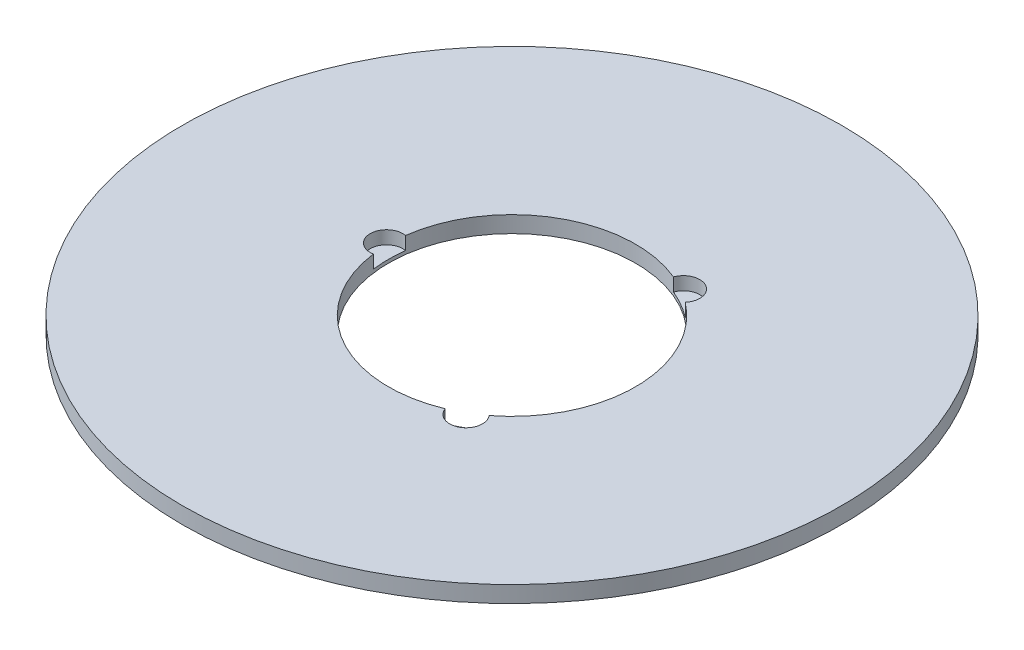
ISO-10303-21;
HEADER;
FILE_DESCRIPTION(('STEP AP214'),'2;1');
FILE_NAME('part.step','',(''),(''),'','','');
FILE_SCHEMA(('AUTOMOTIVE_DESIGN { 1 0 10303 214 1 1 1 1 }'));
ENDSEC;
DATA;
#1=APPLICATION_CONTEXT('core data for automotive mechanical design processes');
#2=APPLICATION_PROTOCOL_DEFINITION('international standard','automotive_design',2000,#1);
#3=PRODUCT_CONTEXT('',#1,'mechanical');
#4=PRODUCT('Part','Part','',(#3));
#5=PRODUCT_RELATED_PRODUCT_CATEGORY('part','',(#4));
#6=PRODUCT_DEFINITION_FORMATION('','',#4);
#7=PRODUCT_DEFINITION_CONTEXT('part definition',#1,'design');
#8=PRODUCT_DEFINITION('design','',#6,#7);
#9=PRODUCT_DEFINITION_SHAPE('','',#8);
#10=(LENGTH_UNIT() NAMED_UNIT(*) SI_UNIT(.MILLI.,.METRE.));
#11=(NAMED_UNIT(*) PLANE_ANGLE_UNIT() SI_UNIT($,.RADIAN.));
#12=(NAMED_UNIT(*) SI_UNIT($,.STERADIAN.) SOLID_ANGLE_UNIT());
#13=UNCERTAINTY_MEASURE_WITH_UNIT(LENGTH_MEASURE(1.E-05),#10,'distance_accuracy_value','');
#14=(GEOMETRIC_REPRESENTATION_CONTEXT(3) GLOBAL_UNCERTAINTY_ASSIGNED_CONTEXT((#13)) GLOBAL_UNIT_ASSIGNED_CONTEXT((#10,
#11,#12)) REPRESENTATION_CONTEXT('',''));
#15=CARTESIAN_POINT('',(0.,0.,0.));
#16=DIRECTION('',(0.,0.,1.));
#17=DIRECTION('',(1.,0.,0.));
#18=AXIS2_PLACEMENT_3D('',#15,#16,#17);
#19=CARTESIAN_POINT('',(0.,4.,0.));
#20=DIRECTION('',(0.,-1.,0.));
#21=DIRECTION('',(0.,0.,-1.));
#22=AXIS2_PLACEMENT_3D('',#19,#20,#21);
#23=CYLINDRICAL_SURFACE('',#22,80.);
#24=CARTESIAN_POINT('',(0.,4.,0.));
#25=DIRECTION('',(0.,1.,0.));
#26=DIRECTION('',(0.,0.,1.));
#27=AXIS2_PLACEMENT_3D('',#24,#25,#26);
#28=CIRCLE('',#27,80.);
#29=CARTESIAN_POINT('',(0.,4.,80.));
#30=VERTEX_POINT('',#29);
#31=EDGE_CURVE('E126',#30,#30,#28,.T.);
#32=ORIENTED_EDGE('',*,*,#31,.F.);
#33=EDGE_LOOP('',(#32));
#34=FACE_BOUND('',#33,.T.);
#35=CARTESIAN_POINT('',(0.,0.,0.));
#36=DIRECTION('',(0.,1.,0.));
#37=DIRECTION('',(0.,0.,1.));
#38=AXIS2_PLACEMENT_3D('',#35,#36,#37);
#39=CIRCLE('',#38,80.);
#40=CARTESIAN_POINT('',(0.,0.,80.));
#41=VERTEX_POINT('',#40);
#42=EDGE_CURVE('E124',#41,#41,#39,.T.);
#43=ORIENTED_EDGE('',*,*,#42,.T.);
#44=EDGE_LOOP('',(#43));
#45=FACE_BOUND('',#44,.T.);
#46=ADVANCED_FACE('F39',(#34,#45),#23,.T.);
#47=CARTESIAN_POINT('',(0.,4.,0.));
#48=DIRECTION('',(0.,1.,0.));
#49=DIRECTION('',(0.,0.,1.));
#50=AXIS2_PLACEMENT_3D('',#47,#48,#49);
#51=PLANE('',#50);
#52=CARTESIAN_POINT('',(15.2293132212951,4.,26.3779442636633));
#53=DIRECTION('',(0.,1.,0.));
#54=DIRECTION('',(0.866025403784436,0.,-0.500000000000004));
#55=AXIS2_PLACEMENT_3D('',#52,#53,#54);
#56=CIRCLE('',#55,3.96898372073853);
#57=CARTESIAN_POINT('',(11.4912276367644,4.,27.711941242));
#58=VERTEX_POINT('',#57);
#59=CARTESIAN_POINT('',(18.2536312853717,4.,23.8076656751077));
#60=VERTEX_POINT('',#59);
#61=EDGE_CURVE('E147',#58,#60,#56,.T.);
#62=ORIENTED_EDGE('',*,*,#61,.F.);
#63=CARTESIAN_POINT('',(0.,4.,0.));
#64=DIRECTION('',(0.,1.,0.));
#65=DIRECTION('',(0.,0.,1.));
#66=AXIS2_PLACEMENT_3D('',#63,#64,#65);
#67=CIRCLE('',#66,30.);
#68=CARTESIAN_POINT('',(-29.7448589221359,4.,3.90427556689231));
#69=VERTEX_POINT('',#68);
#70=EDGE_CURVE('E118',#69,#58,#67,.T.);
#71=ORIENTED_EDGE('',*,*,#70,.F.);
#72=CARTESIAN_POINT('',(-30.45862644259,4.,0.));
#73=DIRECTION('',(0.,1.,0.));
#74=DIRECTION('',(0.,0.,1.));
#75=AXIS2_PLACEMENT_3D('',#72,#73,#74);
#76=CIRCLE('',#75,3.96898372073853);
#77=CARTESIAN_POINT('',(-29.7448589221359,4.,-3.90427556689231));
#78=VERTEX_POINT('',#77);
#79=EDGE_CURVE('E113',#78,#69,#76,.T.);
#80=ORIENTED_EDGE('',*,*,#79,.F.);
#81=CARTESIAN_POINT('',(11.4912276367641,4.,-27.7119412420002));
#82=VERTEX_POINT('',#81);
#83=EDGE_CURVE('E106',#82,#78,#67,.T.);
#84=ORIENTED_EDGE('',*,*,#83,.F.);
#85=CARTESIAN_POINT('',(15.2293132212947,4.,-26.3779442636635));
#86=DIRECTION('',(0.,1.,0.));
#87=DIRECTION('',(-0.866025403784443,0.,-0.499999999999992));
#88=AXIS2_PLACEMENT_3D('',#85,#86,#87);
#89=CIRCLE('',#88,3.96898372073853);
#90=CARTESIAN_POINT('',(18.2536312853714,4.,-23.8076656751079));
#91=VERTEX_POINT('',#90);
#92=EDGE_CURVE('E90',#91,#82,#89,.T.);
#93=ORIENTED_EDGE('',*,*,#92,.F.);
#94=EDGE_CURVE('E116',#60,#91,#67,.T.);
#95=ORIENTED_EDGE('',*,*,#94,.F.);
#96=EDGE_LOOP('',(#62,#71,#80,#84,#93,#95));
#97=FACE_BOUND('',#96,.T.);
#98=ORIENTED_EDGE('',*,*,#31,.T.);
#99=EDGE_LOOP('',(#98));
#100=FACE_BOUND('',#99,.T.);
#101=ADVANCED_FACE('F115',(#97,#100),#51,.T.);
#102=CARTESIAN_POINT('',(0.,0.,0.));
#103=DIRECTION('',(0.,1.,0.));
#104=DIRECTION('',(0.,0.,1.));
#105=AXIS2_PLACEMENT_3D('',#102,#103,#104);
#106=PLANE('',#105);
#107=CARTESIAN_POINT('',(0.,0.,0.));
#108=DIRECTION('',(0.,1.,0.));
#109=DIRECTION('',(0.,0.,1.));
#110=AXIS2_PLACEMENT_3D('',#107,#108,#109);
#111=CIRCLE('',#110,30.);
#112=CARTESIAN_POINT('',(0.,0.,30.));
#113=VERTEX_POINT('',#112);
#114=EDGE_CURVE('E120',#113,#113,#111,.T.);
#115=ORIENTED_EDGE('',*,*,#114,.T.);
#116=EDGE_LOOP('',(#115));
#117=FACE_BOUND('',#116,.T.);
#118=ORIENTED_EDGE('',*,*,#42,.F.);
#119=EDGE_LOOP('',(#118));
#120=FACE_BOUND('',#119,.T.);
#121=ADVANCED_FACE('F164',(#117,#120),#106,.F.);
#122=CARTESIAN_POINT('',(0.,4.,0.));
#123=DIRECTION('',(0.,-1.,0.));
#124=DIRECTION('',(0.,0.,-1.));
#125=AXIS2_PLACEMENT_3D('',#122,#123,#124);
#126=CYLINDRICAL_SURFACE('',#125,30.);
#127=DIRECTION('',(0.,1.,0.));
#128=VECTOR('',#127,1.);
#129=CARTESIAN_POINT('',(11.4912276367644,2.40815884824266,27.711941242));
#130=LINE('',#129,#128);
#131=CARTESIAN_POINT('',(11.4912276367644,0.816317696485319,27.711941242));
#132=VERTEX_POINT('',#131);
#133=EDGE_CURVE('E11',#132,#58,#130,.T.);
#134=ORIENTED_EDGE('',*,*,#133,.F.);
#135=CARTESIAN_POINT('',(0.,0.816317696485319,0.));
#136=DIRECTION('',(0.,1.,0.));
#137=DIRECTION('',(0.,0.,1.));
#138=AXIS2_PLACEMENT_3D('',#135,#136,#137);
#139=CIRCLE('',#138,30.);
#140=CARTESIAN_POINT('',(18.2536312853717,0.816317696485319,23.8076656751077));
#141=VERTEX_POINT('',#140);
#142=EDGE_CURVE('E144',#132,#141,#139,.T.);
#143=ORIENTED_EDGE('',*,*,#142,.T.);
#144=DIRECTION('',(0.,1.,0.));
#145=VECTOR('',#144,1.);
#146=CARTESIAN_POINT('',(18.2536312853717,2.40815884824266,23.8076656751077));
#147=LINE('',#146,#145);
#148=EDGE_CURVE('E46',#60,#141,#147,.F.);
#149=ORIENTED_EDGE('',*,*,#148,.F.);
#150=ORIENTED_EDGE('',*,*,#94,.T.);
#151=DIRECTION('',(0.,1.,0.));
#152=VECTOR('',#151,1.);
#153=CARTESIAN_POINT('',(18.2536312853714,2.40815884824266,-23.8076656751079));
#154=LINE('',#153,#152);
#155=CARTESIAN_POINT('',(18.2536312853714,0.816317696485319,-23.8076656751079));
#156=VERTEX_POINT('',#155);
#157=EDGE_CURVE('E92',#156,#91,#154,.T.);
#158=ORIENTED_EDGE('',*,*,#157,.F.);
#159=CARTESIAN_POINT('',(0.,0.816317696485319,0.));
#160=DIRECTION('',(0.,1.,0.));
#161=DIRECTION('',(0.,0.,1.));
#162=AXIS2_PLACEMENT_3D('',#159,#160,#161);
#163=CIRCLE('',#162,30.);
#164=CARTESIAN_POINT('',(11.4912276367641,0.816317696485319,-27.7119412420002));
#165=VERTEX_POINT('',#164);
#166=EDGE_CURVE('E107',#156,#165,#163,.T.);
#167=ORIENTED_EDGE('',*,*,#166,.T.);
#168=DIRECTION('',(0.,1.,0.));
#169=VECTOR('',#168,1.);
#170=CARTESIAN_POINT('',(11.4912276367641,2.40815884824266,-27.7119412420002));
#171=LINE('',#170,#169);
#172=EDGE_CURVE('E95',#82,#165,#171,.F.);
#173=ORIENTED_EDGE('',*,*,#172,.F.);
#174=ORIENTED_EDGE('',*,*,#83,.T.);
#175=DIRECTION('',(0.,1.,0.));
#176=VECTOR('',#175,1.);
#177=CARTESIAN_POINT('',(-29.7448589221359,2.40815884824266,-3.90427556689231));
#178=LINE('',#177,#176);
#179=CARTESIAN_POINT('',(-29.7448589221359,0.816317696485319,-3.90427556689231));
#180=VERTEX_POINT('',#179);
#181=EDGE_CURVE('E143',#180,#78,#178,.T.);
#182=ORIENTED_EDGE('',*,*,#181,.F.);
#183=CARTESIAN_POINT('',(0.,0.816317696485319,0.));
#184=DIRECTION('',(0.,1.,0.));
#185=DIRECTION('',(0.,0.,1.));
#186=AXIS2_PLACEMENT_3D('',#183,#184,#185);
#187=CIRCLE('',#186,30.);
#188=CARTESIAN_POINT('',(-29.7448589221359,0.816317696485319,3.90427556689231));
#189=VERTEX_POINT('',#188);
#190=EDGE_CURVE('E132',#180,#189,#187,.T.);
#191=ORIENTED_EDGE('',*,*,#190,.T.);
#192=DIRECTION('',(0.,1.,0.));
#193=VECTOR('',#192,1.);
#194=CARTESIAN_POINT('',(-29.7448589221359,2.40815884824266,3.90427556689231));
#195=LINE('',#194,#193);
#196=EDGE_CURVE('E137',#69,#189,#195,.F.);
#197=ORIENTED_EDGE('',*,*,#196,.F.);
#198=ORIENTED_EDGE('',*,*,#70,.T.);
#199=EDGE_LOOP('',(#134,#143,#149,#150,#158,#167,#173,#174,#182,#191,#197,#198));
#200=FACE_BOUND('',#199,.T.);
#201=ORIENTED_EDGE('',*,*,#114,.F.);
#202=EDGE_LOOP('',(#201));
#203=FACE_BOUND('',#202,.T.);
#204=ADVANCED_FACE('F103',(#200,#203),#126,.F.);
#205=CARTESIAN_POINT('',(-30.45862644259,0.816317696485319,0.));
#206=DIRECTION('',(0.,1.,0.));
#207=DIRECTION('',(0.,0.,1.));
#208=AXIS2_PLACEMENT_3D('',#205,#206,#207);
#209=CYLINDRICAL_SURFACE('',#208,3.96898372073853);
#210=ORIENTED_EDGE('',*,*,#181,.T.);
#211=ORIENTED_EDGE('',*,*,#79,.T.);
#212=ORIENTED_EDGE('',*,*,#196,.T.);
#213=CARTESIAN_POINT('',(-30.45862644259,0.816317696485319,0.));
#214=DIRECTION('',(0.,1.,0.));
#215=DIRECTION('',(0.,0.,1.));
#216=AXIS2_PLACEMENT_3D('',#213,#214,#215);
#217=CIRCLE('',#216,3.96898372073853);
#218=EDGE_CURVE('E121',#180,#189,#217,.T.);
#219=ORIENTED_EDGE('',*,*,#218,.F.);
#220=EDGE_LOOP('',(#210,#211,#212,#219));
#221=FACE_BOUND('',#220,.T.);
#222=ADVANCED_FACE('F174',(#221),#209,.F.);
#223=CARTESIAN_POINT('',(-30.45862644259,0.816317696485319,0.));
#224=DIRECTION('',(0.,1.,0.));
#225=DIRECTION('',(0.,0.,1.));
#226=AXIS2_PLACEMENT_3D('',#223,#224,#225);
#227=PLANE('',#226);
#228=ORIENTED_EDGE('',*,*,#218,.T.);
#229=ORIENTED_EDGE('',*,*,#190,.F.);
#230=EDGE_LOOP('',(#228,#229));
#231=FACE_BOUND('',#230,.T.);
#232=ADVANCED_FACE('F177',(#231),#227,.T.);
#233=CARTESIAN_POINT('',(15.2293132212947,0.816317696485319,-26.3779442636635));
#234=DIRECTION('',(0.,1.,0.));
#235=DIRECTION('',(0.,0.,1.));
#236=AXIS2_PLACEMENT_3D('',#233,#234,#235);
#237=CYLINDRICAL_SURFACE('',#236,3.96898372073853);
#238=ORIENTED_EDGE('',*,*,#157,.T.);
#239=ORIENTED_EDGE('',*,*,#92,.T.);
#240=ORIENTED_EDGE('',*,*,#172,.T.);
#241=CARTESIAN_POINT('',(15.2293132212947,0.816317696485319,-26.3779442636635));
#242=DIRECTION('',(0.,1.,0.));
#243=DIRECTION('',(-0.866025403784443,0.,-0.499999999999992));
#244=AXIS2_PLACEMENT_3D('',#241,#242,#243);
#245=CIRCLE('',#244,3.96898372073853);
#246=EDGE_CURVE('E56',#156,#165,#245,.T.);
#247=ORIENTED_EDGE('',*,*,#246,.F.);
#248=EDGE_LOOP('',(#238,#239,#240,#247));
#249=FACE_BOUND('',#248,.T.);
#250=ADVANCED_FACE('F93',(#249),#237,.F.);
#251=CARTESIAN_POINT('',(15.2293132212947,0.816317696485319,-26.3779442636635));
#252=DIRECTION('',(0.,1.,0.));
#253=DIRECTION('',(-0.866025403784443,0.,-0.499999999999992));
#254=AXIS2_PLACEMENT_3D('',#251,#252,#253);
#255=PLANE('',#254);
#256=ORIENTED_EDGE('',*,*,#246,.T.);
#257=ORIENTED_EDGE('',*,*,#166,.F.);
#258=EDGE_LOOP('',(#256,#257));
#259=FACE_BOUND('',#258,.T.);
#260=ADVANCED_FACE('F160',(#259),#255,.T.);
#261=CARTESIAN_POINT('',(15.2293132212951,0.816317696485319,26.3779442636633));
#262=DIRECTION('',(0.,1.,0.));
#263=DIRECTION('',(0.,0.,1.));
#264=AXIS2_PLACEMENT_3D('',#261,#262,#263);
#265=CYLINDRICAL_SURFACE('',#264,3.96898372073853);
#266=ORIENTED_EDGE('',*,*,#133,.T.);
#267=ORIENTED_EDGE('',*,*,#61,.T.);
#268=ORIENTED_EDGE('',*,*,#148,.T.);
#269=CARTESIAN_POINT('',(15.2293132212951,0.816317696485319,26.3779442636633));
#270=DIRECTION('',(0.,1.,0.));
#271=DIRECTION('',(0.866025403784436,0.,-0.500000000000004));
#272=AXIS2_PLACEMENT_3D('',#269,#270,#271);
#273=CIRCLE('',#272,3.96898372073853);
#274=EDGE_CURVE('E55',#132,#141,#273,.T.);
#275=ORIENTED_EDGE('',*,*,#274,.F.);
#276=EDGE_LOOP('',(#266,#267,#268,#275));
#277=FACE_BOUND('',#276,.T.);
#278=ADVANCED_FACE('F149',(#277),#265,.F.);
#279=CARTESIAN_POINT('',(15.2293132212951,0.816317696485319,26.3779442636633));
#280=DIRECTION('',(0.,1.,0.));
#281=DIRECTION('',(0.866025403784436,0.,-0.500000000000004));
#282=AXIS2_PLACEMENT_3D('',#279,#280,#281);
#283=PLANE('',#282);
#284=ORIENTED_EDGE('',*,*,#274,.T.);
#285=ORIENTED_EDGE('',*,*,#142,.F.);
#286=EDGE_LOOP('',(#284,#285));
#287=FACE_BOUND('',#286,.T.);
#288=ADVANCED_FACE('F151',(#287),#283,.T.);
#289=CLOSED_SHELL('',(#46,#101,#121,#204,#222,#232,#250,#260,#278,#288));
#290=MANIFOLD_SOLID_BREP('B2',#289);
#291=ADVANCED_BREP_SHAPE_REPRESENTATION('',(#18,#290),#14);
#292=SHAPE_DEFINITION_REPRESENTATION(#9,#291);
ENDSEC;
END-ISO-10303-21;
